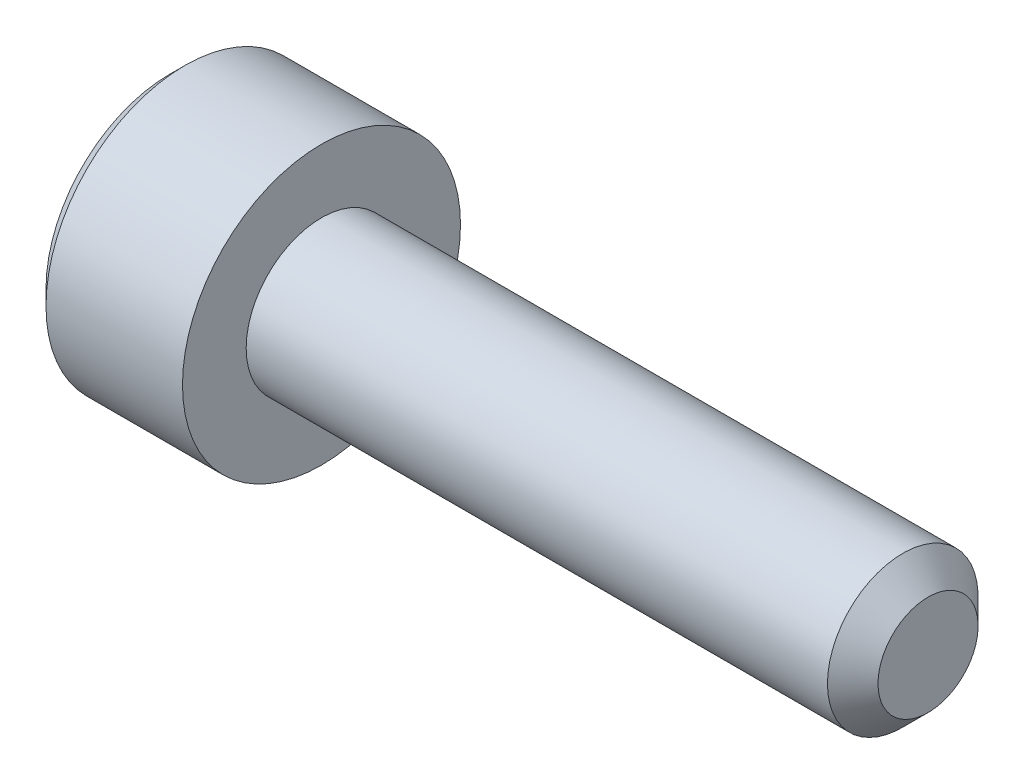
ISO-10303-21;
HEADER;
FILE_DESCRIPTION(('STEP AP214'),'2;1');
FILE_NAME('part.step','',(''),(''),'','','');
FILE_SCHEMA(('AUTOMOTIVE_DESIGN { 1 0 10303 214 1 1 1 1 }'));
ENDSEC;
DATA;
#1=APPLICATION_CONTEXT('core data for automotive mechanical design processes');
#2=APPLICATION_PROTOCOL_DEFINITION('international standard','automotive_design',2000,#1);
#3=PRODUCT_CONTEXT('',#1,'mechanical');
#4=PRODUCT('Part','Part','',(#3));
#5=PRODUCT_RELATED_PRODUCT_CATEGORY('part','',(#4));
#6=PRODUCT_DEFINITION_FORMATION('','',#4);
#7=PRODUCT_DEFINITION_CONTEXT('part definition',#1,'design');
#8=PRODUCT_DEFINITION('design','',#6,#7);
#9=PRODUCT_DEFINITION_SHAPE('','',#8);
#10=(LENGTH_UNIT() NAMED_UNIT(*) SI_UNIT(.MILLI.,.METRE.));
#11=(NAMED_UNIT(*) PLANE_ANGLE_UNIT() SI_UNIT($,.RADIAN.));
#12=(NAMED_UNIT(*) SI_UNIT($,.STERADIAN.) SOLID_ANGLE_UNIT());
#13=UNCERTAINTY_MEASURE_WITH_UNIT(LENGTH_MEASURE(1.E-05),#10,'distance_accuracy_value','');
#14=(GEOMETRIC_REPRESENTATION_CONTEXT(3) GLOBAL_UNCERTAINTY_ASSIGNED_CONTEXT((#13)) GLOBAL_UNIT_ASSIGNED_CONTEXT((#10,
#11,#12)) REPRESENTATION_CONTEXT('',''));
#15=CARTESIAN_POINT('',(0.,0.,0.));
#16=DIRECTION('',(0.,0.,1.));
#17=DIRECTION('',(1.,0.,0.));
#18=AXIS2_PLACEMENT_3D('',#15,#16,#17);
#19=CARTESIAN_POINT('',(0.,0.,0.));
#20=DIRECTION('',(1.,0.,0.));
#21=DIRECTION('',(0.,0.,-1.));
#22=AXIS2_PLACEMENT_3D('',#19,#20,#21);
#23=PLANE('',#22);
#24=DIRECTION('',(0.,0.866025403784439,0.5));
#25=VECTOR('',#24,1.);
#26=CARTESIAN_POINT('',(0.,1.4,-0.98149545762236));
#27=LINE('',#26,#25);
#28=CARTESIAN_POINT('',(0.,0.,-1.78978583448784));
#29=VERTEX_POINT('',#28);
#30=CARTESIAN_POINT('',(0.,1.55,-0.894892917243917));
#31=VERTEX_POINT('',#30);
#32=EDGE_CURVE('E171',#29,#31,#27,.T.);
#33=ORIENTED_EDGE('',*,*,#32,.T.);
#34=DIRECTION('',(0.,0.,1.));
#35=VECTOR('',#34,1.);
#36=CARTESIAN_POINT('',(0.,1.55,0.721687836487032));
#37=LINE('',#36,#35);
#38=CARTESIAN_POINT('',(0.,1.55,0.894892917243918));
#39=VERTEX_POINT('',#38);
#40=EDGE_CURVE('E186',#31,#39,#37,.T.);
#41=ORIENTED_EDGE('',*,*,#40,.T.);
#42=DIRECTION('',(0.,-0.866025403784439,0.5));
#43=VECTOR('',#42,1.);
#44=CARTESIAN_POINT('',(0.,0.149999999999998,1.70318329410939));
#45=LINE('',#44,#43);
#46=CARTESIAN_POINT('',(0.,0.,1.78978583448784));
#47=VERTEX_POINT('',#46);
#48=EDGE_CURVE('E183',#39,#47,#45,.T.);
#49=ORIENTED_EDGE('',*,*,#48,.T.);
#50=DIRECTION('',(0.,-0.866025403784439,-0.5));
#51=VECTOR('',#50,1.);
#52=CARTESIAN_POINT('',(0.,-1.4,0.981495457622361));
#53=LINE('',#52,#51);
#54=CARTESIAN_POINT('',(0.,-1.55,0.894892917243918));
#55=VERTEX_POINT('',#54);
#56=EDGE_CURVE('E180',#47,#55,#53,.T.);
#57=ORIENTED_EDGE('',*,*,#56,.T.);
#58=DIRECTION('',(0.,0.,-1.));
#59=VECTOR('',#58,1.);
#60=CARTESIAN_POINT('',(0.,-1.55,-0.721687836487031));
#61=LINE('',#60,#59);
#62=CARTESIAN_POINT('',(0.,-1.55,-0.894892917243918));
#63=VERTEX_POINT('',#62);
#64=EDGE_CURVE('E177',#55,#63,#61,.T.);
#65=ORIENTED_EDGE('',*,*,#64,.T.);
#66=DIRECTION('',(0.,0.866025403784439,-0.5));
#67=VECTOR('',#66,1.);
#68=CARTESIAN_POINT('',(0.,-0.149999999999998,-1.70318329410939));
#69=LINE('',#68,#67);
#70=EDGE_CURVE('E174',#63,#29,#69,.T.);
#71=ORIENTED_EDGE('',*,*,#70,.T.);
#72=EDGE_LOOP('',(#33,#41,#49,#57,#65,#71));
#73=FACE_BOUND('',#72,.T.);
#74=CARTESIAN_POINT('',(0.,0.,0.));
#75=DIRECTION('',(1.,0.,0.));
#76=DIRECTION('',(0.,0.,-1.));
#77=AXIS2_PLACEMENT_3D('',#74,#75,#76);
#78=CIRCLE('',#77,2.45);
#79=CARTESIAN_POINT('',(0.,0.,-2.45));
#80=VERTEX_POINT('',#79);
#81=EDGE_CURVE('E163',#80,#80,#78,.F.);
#82=ORIENTED_EDGE('',*,*,#81,.T.);
#83=EDGE_LOOP('',(#82));
#84=FACE_BOUND('',#83,.T.);
#85=ADVANCED_FACE('F39',(#73,#84),#23,.F.);
#86=CARTESIAN_POINT('',(15.,0.,0.));
#87=DIRECTION('',(-1.,0.,0.));
#88=DIRECTION('',(0.,0.,1.));
#89=AXIS2_PLACEMENT_3D('',#86,#87,#88);
#90=PLANE('',#89);
#91=CARTESIAN_POINT('',(15.,0.,0.));
#92=DIRECTION('',(-1.,0.,0.));
#93=DIRECTION('',(0.,0.,1.));
#94=AXIS2_PLACEMENT_3D('',#91,#92,#93);
#95=CIRCLE('',#94,0.989999999999987);
#96=CARTESIAN_POINT('',(15.,0.,0.989999999999987));
#97=VERTEX_POINT('',#96);
#98=EDGE_CURVE('E159',#97,#97,#95,.F.);
#99=ORIENTED_EDGE('',*,*,#98,.T.);
#100=EDGE_LOOP('',(#99));
#101=FACE_BOUND('',#100,.T.);
#102=ADVANCED_FACE('F286',(#101),#90,.F.);
#103=CARTESIAN_POINT('',(-88.7054908485857,0.,0.));
#104=DIRECTION('',(-1.,0.,0.));
#105=DIRECTION('',(0.,0.,1.));
#106=AXIS2_PLACEMENT_3D('',#103,#104,#105);
#107=CYLINDRICAL_SURFACE('',#106,1.49);
#108=CARTESIAN_POINT('',(14.5,0.,0.));
#109=DIRECTION('',(-1.,0.,0.));
#110=DIRECTION('',(0.,0.,1.));
#111=AXIS2_PLACEMENT_3D('',#108,#109,#110);
#112=CIRCLE('',#111,1.49);
#113=CARTESIAN_POINT('',(14.5,0.,1.49));
#114=VERTEX_POINT('',#113);
#115=EDGE_CURVE('E155',#114,#114,#112,.T.);
#116=ORIENTED_EDGE('',*,*,#115,.T.);
#117=EDGE_LOOP('',(#116));
#118=FACE_BOUND('',#117,.T.);
#119=CARTESIAN_POINT('',(3.,0.,0.));
#120=DIRECTION('',(-1.,0.,0.));
#121=DIRECTION('',(0.,0.,1.));
#122=AXIS2_PLACEMENT_3D('',#119,#120,#121);
#123=CIRCLE('',#122,1.49);
#124=CARTESIAN_POINT('',(3.,0.,1.49));
#125=VERTEX_POINT('',#124);
#126=EDGE_CURVE('E146',#125,#125,#123,.T.);
#127=ORIENTED_EDGE('',*,*,#126,.F.);
#128=EDGE_LOOP('',(#127));
#129=FACE_BOUND('',#128,.T.);
#130=ADVANCED_FACE('F291',(#118,#129),#107,.T.);
#131=CARTESIAN_POINT('',(3.,1.49,0.));
#132=DIRECTION('',(-1.,0.,0.));
#133=DIRECTION('',(0.,0.,1.));
#134=AXIS2_PLACEMENT_3D('',#131,#132,#133);
#135=PLANE('',#134);
#136=CARTESIAN_POINT('',(3.,0.,0.));
#137=DIRECTION('',(-1.,0.,0.));
#138=DIRECTION('',(0.,0.,1.));
#139=AXIS2_PLACEMENT_3D('',#136,#137,#138);
#140=CIRCLE('',#139,2.75);
#141=CARTESIAN_POINT('',(3.,0.,2.75));
#142=VERTEX_POINT('',#141);
#143=EDGE_CURVE('E140',#142,#142,#140,.T.);
#144=ORIENTED_EDGE('',*,*,#143,.F.);
#145=EDGE_LOOP('',(#144));
#146=FACE_BOUND('',#145,.T.);
#147=ORIENTED_EDGE('',*,*,#126,.T.);
#148=EDGE_LOOP('',(#147));
#149=FACE_BOUND('',#148,.T.);
#150=ADVANCED_FACE('F301',(#146,#149),#135,.F.);
#151=CARTESIAN_POINT('',(-88.7054908485857,0.,0.));
#152=DIRECTION('',(-1.,0.,0.));
#153=DIRECTION('',(0.,0.,1.));
#154=AXIS2_PLACEMENT_3D('',#151,#152,#153);
#155=CYLINDRICAL_SURFACE('',#154,2.75);
#156=CARTESIAN_POINT('',(0.299999999999995,0.,0.));
#157=DIRECTION('',(1.,0.,0.));
#158=DIRECTION('',(0.,0.,-1.));
#159=AXIS2_PLACEMENT_3D('',#156,#157,#158);
#160=CIRCLE('',#159,2.75);
#161=CARTESIAN_POINT('',(0.299999999999995,0.,-2.75));
#162=VERTEX_POINT('',#161);
#163=EDGE_CURVE('E167',#162,#162,#160,.T.);
#164=ORIENTED_EDGE('',*,*,#163,.T.);
#165=EDGE_LOOP('',(#164));
#166=FACE_BOUND('',#165,.T.);
#167=ORIENTED_EDGE('',*,*,#143,.T.);
#168=EDGE_LOOP('',(#167));
#169=FACE_BOUND('',#168,.T.);
#170=ADVANCED_FACE('F297',(#166,#169),#155,.T.);
#171=CARTESIAN_POINT('',(14.5,0.,0.));
#172=DIRECTION('',(-1.,0.,0.));
#173=DIRECTION('',(0.,0.,1.));
#174=AXIS2_PLACEMENT_3D('',#171,#172,#173);
#175=CONICAL_SURFACE('',#174,1.49,0.785398163397444);
#176=ORIENTED_EDGE('',*,*,#98,.F.);
#177=EDGE_LOOP('',(#176));
#178=FACE_BOUND('',#177,.T.);
#179=ORIENTED_EDGE('',*,*,#115,.F.);
#180=EDGE_LOOP('',(#179));
#181=FACE_BOUND('',#180,.T.);
#182=ADVANCED_FACE('F300',(#178,#181),#175,.T.);
#183=CARTESIAN_POINT('',(0.,0.,0.));
#184=DIRECTION('',(1.,0.,0.));
#185=DIRECTION('',(0.,0.,-1.));
#186=AXIS2_PLACEMENT_3D('',#183,#184,#185);
#187=CONICAL_SURFACE('',#186,2.45,0.785398163397458);
#188=ORIENTED_EDGE('',*,*,#163,.F.);
#189=EDGE_LOOP('',(#188));
#190=FACE_BOUND('',#189,.T.);
#191=ORIENTED_EDGE('',*,*,#81,.F.);
#192=EDGE_LOOP('',(#191));
#193=FACE_BOUND('',#192,.T.);
#194=ADVANCED_FACE('F311',(#190,#193),#187,.T.);
#195=CARTESIAN_POINT('',(2.5,1.25,0.721687836487032));
#196=DIRECTION('',(0.,-0.5,-0.866025403784438));
#197=DIRECTION('',(0.,0.866025403784439,-0.5));
#198=AXIS2_PLACEMENT_3D('',#195,#196,#197);
#199=PLANE('',#198);
#200=DIRECTION('',(-1.,0.,0.));
#201=VECTOR('',#200,1.);
#202=CARTESIAN_POINT('',(2.5,0.,1.44337567297407));
#203=LINE('',#202,#201);
#204=CARTESIAN_POINT('',(2.5,0.,1.44337567297407));
#205=VERTEX_POINT('',#204);
#206=CARTESIAN_POINT('',(0.3,0.,1.44337567297407));
#207=VERTEX_POINT('',#206);
#208=EDGE_CURVE('E130',#205,#207,#203,.T.);
#209=ORIENTED_EDGE('',*,*,#208,.T.);
#210=DIRECTION('',(0.,0.866025403784439,-0.5));
#211=VECTOR('',#210,1.);
#212=CARTESIAN_POINT('',(0.3,1.25,0.721687836487032));
#213=LINE('',#212,#211);
#214=CARTESIAN_POINT('',(0.3,1.25,0.721687836487032));
#215=VERTEX_POINT('',#214);
#216=EDGE_CURVE('E194',#207,#215,#213,.T.);
#217=ORIENTED_EDGE('',*,*,#216,.T.);
#218=DIRECTION('',(-1.,0.,0.));
#219=VECTOR('',#218,1.);
#220=CARTESIAN_POINT('',(2.5,1.25,0.721687836487032));
#221=LINE('',#220,#219);
#222=CARTESIAN_POINT('',(2.5,1.25,0.721687836487032));
#223=VERTEX_POINT('',#222);
#224=EDGE_CURVE('E133',#223,#215,#221,.T.);
#225=ORIENTED_EDGE('',*,*,#224,.F.);
#226=DIRECTION('',(0.,-0.866025403784439,0.5));
#227=VECTOR('',#226,1.);
#228=CARTESIAN_POINT('',(2.5,1.25,0.721687836487032));
#229=LINE('',#228,#227);
#230=EDGE_CURVE('E117',#223,#205,#229,.T.);
#231=ORIENTED_EDGE('',*,*,#230,.T.);
#232=EDGE_LOOP('',(#209,#217,#225,#231));
#233=FACE_BOUND('',#232,.T.);
#234=ADVANCED_FACE('F129',(#233),#199,.T.);
#235=CARTESIAN_POINT('',(2.5,0.,1.44337567297407));
#236=DIRECTION('',(0.,0.5,-0.866025403784438));
#237=DIRECTION('',(0.,0.866025403784439,0.5));
#238=AXIS2_PLACEMENT_3D('',#235,#236,#237);
#239=PLANE('',#238);
#240=DIRECTION('',(-1.,0.,0.));
#241=VECTOR('',#240,1.);
#242=CARTESIAN_POINT('',(2.5,-1.25,0.721687836487033));
#243=LINE('',#242,#241);
#244=CARTESIAN_POINT('',(2.5,-1.25,0.721687836487033));
#245=VERTEX_POINT('',#244);
#246=CARTESIAN_POINT('',(0.3,-1.25,0.721687836487033));
#247=VERTEX_POINT('',#246);
#248=EDGE_CURVE('E141',#245,#247,#243,.T.);
#249=ORIENTED_EDGE('',*,*,#248,.T.);
#250=DIRECTION('',(0.,0.866025403784439,0.5));
#251=VECTOR('',#250,1.);
#252=CARTESIAN_POINT('',(0.3,0.,1.44337567297407));
#253=LINE('',#252,#251);
#254=EDGE_CURVE('E138',#247,#207,#253,.T.);
#255=ORIENTED_EDGE('',*,*,#254,.T.);
#256=ORIENTED_EDGE('',*,*,#208,.F.);
#257=DIRECTION('',(0.,-0.866025403784439,-0.5));
#258=VECTOR('',#257,1.);
#259=CARTESIAN_POINT('',(2.5,0.,1.44337567297407));
#260=LINE('',#259,#258);
#261=EDGE_CURVE('E113',#205,#245,#260,.T.);
#262=ORIENTED_EDGE('',*,*,#261,.T.);
#263=EDGE_LOOP('',(#249,#255,#256,#262));
#264=FACE_BOUND('',#263,.T.);
#265=ADVANCED_FACE('F136',(#264),#239,.T.);
#266=CARTESIAN_POINT('',(2.5,-1.25,0.721687836487033));
#267=DIRECTION('',(0.,1.,0.));
#268=DIRECTION('',(0.,0.,1.));
#269=AXIS2_PLACEMENT_3D('',#266,#267,#268);
#270=PLANE('',#269);
#271=DIRECTION('',(-1.,0.,0.));
#272=VECTOR('',#271,1.);
#273=CARTESIAN_POINT('',(2.5,-1.25,-0.721687836487031));
#274=LINE('',#273,#272);
#275=CARTESIAN_POINT('',(2.5,-1.25,-0.721687836487031));
#276=VERTEX_POINT('',#275);
#277=CARTESIAN_POINT('',(0.3,-1.25,-0.721687836487031));
#278=VERTEX_POINT('',#277);
#279=EDGE_CURVE('E148',#276,#278,#274,.T.);
#280=ORIENTED_EDGE('',*,*,#279,.T.);
#281=DIRECTION('',(0.,0.,1.));
#282=VECTOR('',#281,1.);
#283=CARTESIAN_POINT('',(0.3,-1.25,0.721687836487033));
#284=LINE('',#283,#282);
#285=EDGE_CURVE('E199',#278,#247,#284,.T.);
#286=ORIENTED_EDGE('',*,*,#285,.T.);
#287=ORIENTED_EDGE('',*,*,#248,.F.);
#288=DIRECTION('',(0.,0.,-1.));
#289=VECTOR('',#288,1.);
#290=CARTESIAN_POINT('',(2.5,-1.25,0.721687836487033));
#291=LINE('',#290,#289);
#292=EDGE_CURVE('E119',#245,#276,#291,.T.);
#293=ORIENTED_EDGE('',*,*,#292,.T.);
#294=EDGE_LOOP('',(#280,#286,#287,#293));
#295=FACE_BOUND('',#294,.T.);
#296=ADVANCED_FACE('F234',(#295),#270,.T.);
#297=CARTESIAN_POINT('',(2.5,-1.25,-0.721687836487031));
#298=DIRECTION('',(0.,0.5,0.866025403784439));
#299=DIRECTION('',(0.,-0.866025403784439,0.5));
#300=AXIS2_PLACEMENT_3D('',#297,#298,#299);
#301=PLANE('',#300);
#302=DIRECTION('',(-1.,0.,0.));
#303=VECTOR('',#302,1.);
#304=CARTESIAN_POINT('',(2.5,0.,-1.44337567297406));
#305=LINE('',#304,#303);
#306=CARTESIAN_POINT('',(2.5,0.,-1.44337567297406));
#307=VERTEX_POINT('',#306);
#308=CARTESIAN_POINT('',(0.3,0.,-1.44337567297406));
#309=VERTEX_POINT('',#308);
#310=EDGE_CURVE('E236',#307,#309,#305,.T.);
#311=ORIENTED_EDGE('',*,*,#310,.T.);
#312=DIRECTION('',(0.,-0.866025403784439,0.5));
#313=VECTOR('',#312,1.);
#314=CARTESIAN_POINT('',(0.3,-1.25,-0.721687836487031));
#315=LINE('',#314,#313);
#316=EDGE_CURVE('E49',#309,#278,#315,.T.);
#317=ORIENTED_EDGE('',*,*,#316,.T.);
#318=ORIENTED_EDGE('',*,*,#279,.F.);
#319=DIRECTION('',(0.,0.866025403784439,-0.499999999999999));
#320=VECTOR('',#319,1.);
#321=CARTESIAN_POINT('',(2.5,-1.25,-0.721687836487031));
#322=LINE('',#321,#320);
#323=EDGE_CURVE('E251',#276,#307,#322,.T.);
#324=ORIENTED_EDGE('',*,*,#323,.T.);
#325=EDGE_LOOP('',(#311,#317,#318,#324));
#326=FACE_BOUND('',#325,.T.);
#327=ADVANCED_FACE('F255',(#326),#301,.T.);
#328=CARTESIAN_POINT('',(2.5,0.,-1.44337567297406));
#329=DIRECTION('',(0.,-0.5,0.866025403784439));
#330=DIRECTION('',(0.,-0.866025403784439,-0.5));
#331=AXIS2_PLACEMENT_3D('',#328,#329,#330);
#332=PLANE('',#331);
#333=DIRECTION('',(-1.,0.,0.));
#334=VECTOR('',#333,1.);
#335=CARTESIAN_POINT('',(2.5,1.25,-0.72168783648703));
#336=LINE('',#335,#334);
#337=CARTESIAN_POINT('',(2.5,1.25,-0.72168783648703));
#338=VERTEX_POINT('',#337);
#339=CARTESIAN_POINT('',(0.3,1.25,-0.72168783648703));
#340=VERTEX_POINT('',#339);
#341=EDGE_CURVE('E238',#338,#340,#336,.T.);
#342=ORIENTED_EDGE('',*,*,#341,.T.);
#343=DIRECTION('',(0.,-0.866025403784439,-0.5));
#344=VECTOR('',#343,1.);
#345=CARTESIAN_POINT('',(0.3,0.,-1.44337567297406));
#346=LINE('',#345,#344);
#347=EDGE_CURVE('E11',#340,#309,#346,.T.);
#348=ORIENTED_EDGE('',*,*,#347,.T.);
#349=ORIENTED_EDGE('',*,*,#310,.F.);
#350=DIRECTION('',(0.,0.866025403784438,0.5));
#351=VECTOR('',#350,1.);
#352=CARTESIAN_POINT('',(2.5,0.,-1.44337567297406));
#353=LINE('',#352,#351);
#354=EDGE_CURVE('E248',#307,#338,#353,.T.);
#355=ORIENTED_EDGE('',*,*,#354,.T.);
#356=EDGE_LOOP('',(#342,#348,#349,#355));
#357=FACE_BOUND('',#356,.T.);
#358=ADVANCED_FACE('F257',(#357),#332,.T.);
#359=CARTESIAN_POINT('',(2.5,1.25,-0.72168783648703));
#360=DIRECTION('',(0.,-1.,0.));
#361=DIRECTION('',(0.,0.,-1.));
#362=AXIS2_PLACEMENT_3D('',#359,#360,#361);
#363=PLANE('',#362);
#364=ORIENTED_EDGE('',*,*,#224,.T.);
#365=DIRECTION('',(0.,0.,-1.));
#366=VECTOR('',#365,1.);
#367=CARTESIAN_POINT('',(0.3,1.25,-0.72168783648703));
#368=LINE('',#367,#366);
#369=EDGE_CURVE('E190',#215,#340,#368,.T.);
#370=ORIENTED_EDGE('',*,*,#369,.T.);
#371=ORIENTED_EDGE('',*,*,#341,.F.);
#372=DIRECTION('',(0.,0.,1.));
#373=VECTOR('',#372,1.);
#374=CARTESIAN_POINT('',(2.5,1.25,-0.72168783648703));
#375=LINE('',#374,#373);
#376=EDGE_CURVE('E245',#338,#223,#375,.T.);
#377=ORIENTED_EDGE('',*,*,#376,.T.);
#378=EDGE_LOOP('',(#364,#370,#371,#377));
#379=FACE_BOUND('',#378,.T.);
#380=ADVANCED_FACE('F260',(#379),#363,.T.);
#381=CARTESIAN_POINT('',(2.5,0.,0.));
#382=DIRECTION('',(1.,0.,0.));
#383=DIRECTION('',(0.,0.,-1.));
#384=AXIS2_PLACEMENT_3D('',#381,#382,#383);
#385=PLANE('',#384);
#386=ORIENTED_EDGE('',*,*,#230,.F.);
#387=ORIENTED_EDGE('',*,*,#376,.F.);
#388=ORIENTED_EDGE('',*,*,#354,.F.);
#389=ORIENTED_EDGE('',*,*,#323,.F.);
#390=ORIENTED_EDGE('',*,*,#292,.F.);
#391=ORIENTED_EDGE('',*,*,#261,.F.);
#392=EDGE_LOOP('',(#386,#387,#388,#389,#390,#391));
#393=FACE_BOUND('',#392,.T.);
#394=ADVANCED_FACE('F115',(#393),#385,.F.);
#395=CARTESIAN_POINT('',(0.,-1.55,0.));
#396=DIRECTION('',(-0.707106781186545,0.70710678118655,0.));
#397=DIRECTION('',(0.,0.,1.));
#398=AXIS2_PLACEMENT_3D('',#395,#396,#397);
#399=PLANE('',#398);
#400=DIRECTION('',(0.65465367070798,0.654653670707975,-0.377964473009225));
#401=VECTOR('',#400,1.);
#402=CARTESIAN_POINT('',(0.221428571428572,-1.32857142857143,0.767051071923359));
#403=LINE('',#402,#401);
#404=EDGE_CURVE('E217',#247,#55,#403,.F.);
#405=ORIENTED_EDGE('',*,*,#404,.F.);
#406=ORIENTED_EDGE('',*,*,#285,.F.);
#407=DIRECTION('',(0.65465367070798,0.654653670707975,0.377964473009226));
#408=VECTOR('',#407,1.);
#409=CARTESIAN_POINT('',(0.221428571428571,-1.32857142857143,-0.767051071923359));
#410=LINE('',#409,#408);
#411=EDGE_CURVE('E43',#63,#278,#410,.T.);
#412=ORIENTED_EDGE('',*,*,#411,.F.);
#413=ORIENTED_EDGE('',*,*,#64,.F.);
#414=EDGE_LOOP('',(#405,#406,#412,#413));
#415=FACE_BOUND('',#414,.T.);
#416=ADVANCED_FACE('F41',(#415),#399,.T.);
#417=CARTESIAN_POINT('',(0.,-0.774999999999998,-1.34233937586588));
#418=DIRECTION('',(-0.707106781186545,0.353553390593275,0.612372435695797));
#419=DIRECTION('',(0.,-0.866025403784439,0.5));
#420=AXIS2_PLACEMENT_3D('',#417,#418,#419);
#421=PLANE('',#420);
#422=ORIENTED_EDGE('',*,*,#411,.T.);
#423=ORIENTED_EDGE('',*,*,#316,.F.);
#424=DIRECTION('',(0.65465367070798,0.,0.755928946018452));
#425=VECTOR('',#424,1.);
#426=CARTESIAN_POINT('',(0.221428571428571,0.,-1.53410214384672));
#427=LINE('',#426,#425);
#428=EDGE_CURVE('E214',#29,#309,#427,.T.);
#429=ORIENTED_EDGE('',*,*,#428,.F.);
#430=ORIENTED_EDGE('',*,*,#70,.F.);
#431=EDGE_LOOP('',(#422,#423,#429,#430));
#432=FACE_BOUND('',#431,.T.);
#433=ADVANCED_FACE('F228',(#432),#421,.T.);
#434=CARTESIAN_POINT('',(0.,-0.774999999999999,1.34233937586588));
#435=DIRECTION('',(-0.707106781186544,0.353553390593276,-0.612372435695797));
#436=DIRECTION('',(0.,0.866025403784439,0.5));
#437=AXIS2_PLACEMENT_3D('',#434,#435,#436);
#438=PLANE('',#437);
#439=ORIENTED_EDGE('',*,*,#404,.T.);
#440=ORIENTED_EDGE('',*,*,#56,.F.);
#441=DIRECTION('',(0.654653670707981,0.,-0.755928946018451));
#442=VECTOR('',#441,1.);
#443=CARTESIAN_POINT('',(0.221428571428572,0.,1.53410214384672));
#444=LINE('',#443,#442);
#445=EDGE_CURVE('E210',#207,#47,#444,.F.);
#446=ORIENTED_EDGE('',*,*,#445,.F.);
#447=ORIENTED_EDGE('',*,*,#254,.F.);
#448=EDGE_LOOP('',(#439,#440,#446,#447));
#449=FACE_BOUND('',#448,.T.);
#450=ADVANCED_FACE('F277',(#449),#438,.T.);
#451=CARTESIAN_POINT('',(0.,0.774999999999999,-1.34233937586588));
#452=DIRECTION('',(-0.707106781186545,-0.353553390593275,0.612372435695797));
#453=DIRECTION('',(0.,-0.866025403784439,-0.5));
#454=AXIS2_PLACEMENT_3D('',#451,#452,#453);
#455=PLANE('',#454);
#456=ORIENTED_EDGE('',*,*,#428,.T.);
#457=ORIENTED_EDGE('',*,*,#347,.F.);
#458=DIRECTION('',(-0.65465367070798,0.654653670707975,-0.377964473009226));
#459=VECTOR('',#458,1.);
#460=CARTESIAN_POINT('',(0.221428571428571,1.32857142857143,-0.767051071923358));
#461=LINE('',#460,#459);
#462=EDGE_CURVE('E207',#31,#340,#461,.F.);
#463=ORIENTED_EDGE('',*,*,#462,.F.);
#464=ORIENTED_EDGE('',*,*,#32,.F.);
#465=EDGE_LOOP('',(#456,#457,#463,#464));
#466=FACE_BOUND('',#465,.T.);
#467=ADVANCED_FACE('F275',(#466),#455,.T.);
#468=CARTESIAN_POINT('',(0.,0.774999999999999,1.34233937586588));
#469=DIRECTION('',(-0.707106781186544,-0.353553390593276,-0.612372435695797));
#470=DIRECTION('',(0.,0.866025403784439,-0.5));
#471=AXIS2_PLACEMENT_3D('',#468,#469,#470);
#472=PLANE('',#471);
#473=ORIENTED_EDGE('',*,*,#445,.T.);
#474=ORIENTED_EDGE('',*,*,#48,.F.);
#475=DIRECTION('',(0.654653670707981,-0.654653670707975,-0.377964473009225));
#476=VECTOR('',#475,1.);
#477=CARTESIAN_POINT('',(0.221428571428571,1.32857142857143,0.767051071923359));
#478=LINE('',#477,#476);
#479=EDGE_CURVE('E204',#215,#39,#478,.F.);
#480=ORIENTED_EDGE('',*,*,#479,.F.);
#481=ORIENTED_EDGE('',*,*,#216,.F.);
#482=EDGE_LOOP('',(#473,#474,#480,#481));
#483=FACE_BOUND('',#482,.T.);
#484=ADVANCED_FACE('F270',(#483),#472,.T.);
#485=CARTESIAN_POINT('',(0.,1.55,0.));
#486=DIRECTION('',(-0.707106781186544,-0.707106781186551,0.));
#487=DIRECTION('',(0.,0.,-1.));
#488=AXIS2_PLACEMENT_3D('',#485,#486,#487);
#489=PLANE('',#488);
#490=ORIENTED_EDGE('',*,*,#462,.T.);
#491=ORIENTED_EDGE('',*,*,#369,.F.);
#492=ORIENTED_EDGE('',*,*,#479,.T.);
#493=ORIENTED_EDGE('',*,*,#40,.F.);
#494=EDGE_LOOP('',(#490,#491,#492,#493));
#495=FACE_BOUND('',#494,.T.);
#496=ADVANCED_FACE('F264',(#495),#489,.T.);
#497=CLOSED_SHELL('',(#85,#102,#130,#150,#170,#182,#194,#234,#265,#296,#327,#358,#380,#394,#416,
#433,#450,#467,#484,#496));
#498=MANIFOLD_SOLID_BREP('B2',#497);
#499=ADVANCED_BREP_SHAPE_REPRESENTATION('',(#18,#498),#14);
#500=SHAPE_DEFINITION_REPRESENTATION(#9,#499);
ENDSEC;
END-ISO-10303-21;
